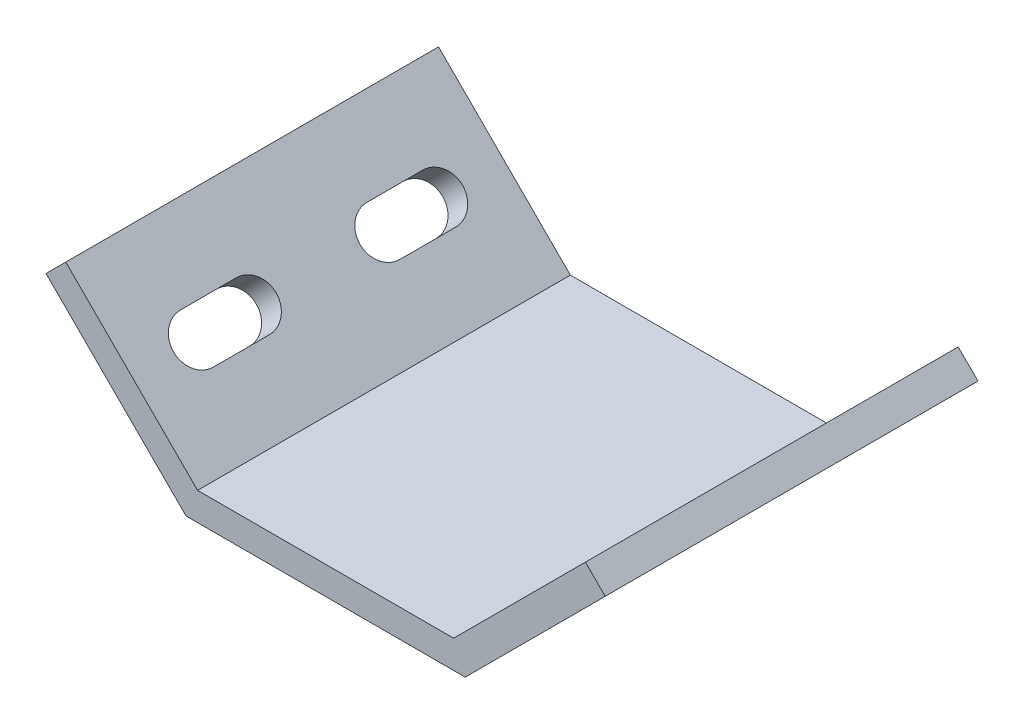
ISO-10303-21;
HEADER;
FILE_DESCRIPTION(('STEP AP214'),'2;1');
FILE_NAME('part.step','',(''),(''),'','','');
FILE_SCHEMA(('AUTOMOTIVE_DESIGN { 1 0 10303 214 1 1 1 1 }'));
ENDSEC;
DATA;
#1=APPLICATION_CONTEXT('core data for automotive mechanical design processes');
#2=APPLICATION_PROTOCOL_DEFINITION('international standard','automotive_design',2000,#1);
#3=PRODUCT_CONTEXT('',#1,'mechanical');
#4=PRODUCT('Part','Part','',(#3));
#5=PRODUCT_RELATED_PRODUCT_CATEGORY('part','',(#4));
#6=PRODUCT_DEFINITION_FORMATION('','',#4);
#7=PRODUCT_DEFINITION_CONTEXT('part definition',#1,'design');
#8=PRODUCT_DEFINITION('design','',#6,#7);
#9=PRODUCT_DEFINITION_SHAPE('','',#8);
#10=(LENGTH_UNIT() NAMED_UNIT(*) SI_UNIT(.MILLI.,.METRE.));
#11=(NAMED_UNIT(*) PLANE_ANGLE_UNIT() SI_UNIT($,.RADIAN.));
#12=(NAMED_UNIT(*) SI_UNIT($,.STERADIAN.) SOLID_ANGLE_UNIT());
#13=UNCERTAINTY_MEASURE_WITH_UNIT(LENGTH_MEASURE(1.E-05),#10,'distance_accuracy_value','');
#14=(GEOMETRIC_REPRESENTATION_CONTEXT(3) GLOBAL_UNCERTAINTY_ASSIGNED_CONTEXT((#13)) GLOBAL_UNIT_ASSIGNED_CONTEXT((#10,
#11,#12)) REPRESENTATION_CONTEXT('',''));
#15=CARTESIAN_POINT('',(0.,0.,0.));
#16=DIRECTION('',(0.,0.,1.));
#17=DIRECTION('',(1.,0.,0.));
#18=AXIS2_PLACEMENT_3D('',#15,#16,#17);
#19=CARTESIAN_POINT('',(15.8578643762691,-2.12132034355965,20.));
#20=DIRECTION('',(-0.707106781186546,0.707106781186549,0.));
#21=DIRECTION('',(-0.707106781186549,-0.707106781186546,0.));
#22=AXIS2_PLACEMENT_3D('',#19,#20,#21);
#23=PLANE('',#22);
#24=DIRECTION('',(0.,0.,-1.));
#25=VECTOR('',#24,1.);
#26=CARTESIAN_POINT('',(14.9791847198287,-3.,20.));
#27=LINE('',#26,#25);
#28=CARTESIAN_POINT('',(14.9791847198287,-3.,20.));
#29=VERTEX_POINT('',#28);
#30=CARTESIAN_POINT('',(14.9791847198287,-3.,-20.));
#31=VERTEX_POINT('',#30);
#32=EDGE_CURVE('E341',#29,#31,#27,.T.);
#33=ORIENTED_EDGE('',*,*,#32,.T.);
#34=DIRECTION('',(0.707106781186549,0.707106781186546,0.));
#35=VECTOR('',#34,1.);
#36=CARTESIAN_POINT('',(15.8578643762691,-2.12132034355965,-20.));
#37=LINE('',#36,#35);
#38=CARTESIAN_POINT('',(30.,12.0208152801712,-20.));
#39=VERTEX_POINT('',#38);
#40=EDGE_CURVE('E234',#31,#39,#37,.T.);
#41=ORIENTED_EDGE('',*,*,#40,.T.);
#42=DIRECTION('',(0.,0.,-1.));
#43=VECTOR('',#42,1.);
#44=CARTESIAN_POINT('',(30.,12.0208152801712,20.));
#45=LINE('',#44,#43);
#46=CARTESIAN_POINT('',(30.,12.0208152801712,20.));
#47=VERTEX_POINT('',#46);
#48=EDGE_CURVE('E355',#47,#39,#45,.T.);
#49=ORIENTED_EDGE('',*,*,#48,.F.);
#50=DIRECTION('',(0.707106781186549,0.707106781186546,0.));
#51=VECTOR('',#50,1.);
#52=CARTESIAN_POINT('',(15.8578643762691,-2.12132034355965,20.));
#53=LINE('',#52,#51);
#54=EDGE_CURVE('E314',#29,#47,#53,.T.);
#55=ORIENTED_EDGE('',*,*,#54,.F.);
#56=EDGE_LOOP('',(#33,#41,#49,#55));
#57=FACE_BOUND('',#56,.T.);
#58=CARTESIAN_POINT('',(22.9289321881345,4.94974746830579,7.));
#59=DIRECTION('',(-0.707106781186546,0.707106781186549,0.));
#60=DIRECTION('',(-0.707106781186549,-0.707106781186546,0.));
#61=AXIS2_PLACEMENT_3D('',#58,#59,#60);
#62=CIRCLE('',#61,2.5);
#63=CARTESIAN_POINT('',(21.1611652351682,3.18198051533942,7.));
#64=VERTEX_POINT('',#63);
#65=CARTESIAN_POINT('',(24.6966991411009,6.71751442127216,7.));
#66=VERTEX_POINT('',#65);
#67=EDGE_CURVE('E298',#64,#66,#62,.F.);
#68=ORIENTED_EDGE('',*,*,#67,.F.);
#69=DIRECTION('',(0.,0.,-1.));
#70=VECTOR('',#69,1.);
#71=CARTESIAN_POINT('',(21.1611652351682,3.18198051533942,20.));
#72=LINE('',#71,#70);
#73=CARTESIAN_POINT('',(21.1611652351682,3.18198051533942,13.));
#74=VERTEX_POINT('',#73);
#75=EDGE_CURVE('E288',#74,#64,#72,.T.);
#76=ORIENTED_EDGE('',*,*,#75,.F.);
#77=CARTESIAN_POINT('',(22.9289321881345,4.94974746830579,13.));
#78=DIRECTION('',(-0.707106781186546,0.707106781186549,0.));
#79=DIRECTION('',(-0.707106781186549,-0.707106781186546,0.));
#80=AXIS2_PLACEMENT_3D('',#77,#78,#79);
#81=CIRCLE('',#80,2.5);
#82=CARTESIAN_POINT('',(24.6966991411009,6.71751442127216,13.));
#83=VERTEX_POINT('',#82);
#84=EDGE_CURVE('E294',#83,#74,#81,.F.);
#85=ORIENTED_EDGE('',*,*,#84,.F.);
#86=DIRECTION('',(0.,0.,1.));
#87=VECTOR('',#86,1.);
#88=CARTESIAN_POINT('',(24.6966991411009,6.71751442127216,20.));
#89=LINE('',#88,#87);
#90=EDGE_CURVE('E296',#66,#83,#89,.T.);
#91=ORIENTED_EDGE('',*,*,#90,.F.);
#92=EDGE_LOOP('',(#68,#76,#85,#91));
#93=FACE_BOUND('',#92,.T.);
#94=CARTESIAN_POINT('',(22.9289321881345,4.94974746830579,-7.));
#95=DIRECTION('',(0.707106781186546,-0.707106781186549,0.));
#96=DIRECTION('',(-0.707106781186549,-0.707106781186546,0.));
#97=AXIS2_PLACEMENT_3D('',#94,#95,#96);
#98=CIRCLE('',#97,2.5);
#99=CARTESIAN_POINT('',(21.1611652351682,3.18198051533942,-7.));
#100=VERTEX_POINT('',#99);
#101=CARTESIAN_POINT('',(24.6966991411009,6.71751442127216,-7.));
#102=VERTEX_POINT('',#101);
#103=EDGE_CURVE('E216',#100,#102,#98,.F.);
#104=ORIENTED_EDGE('',*,*,#103,.T.);
#105=DIRECTION('',(0.,0.,-1.));
#106=VECTOR('',#105,1.);
#107=CARTESIAN_POINT('',(24.6966991411009,6.71751442127216,-20.));
#108=LINE('',#107,#106);
#109=CARTESIAN_POINT('',(24.6966991411009,6.71751442127216,-13.));
#110=VERTEX_POINT('',#109);
#111=EDGE_CURVE('E213',#102,#110,#108,.T.);
#112=ORIENTED_EDGE('',*,*,#111,.T.);
#113=CARTESIAN_POINT('',(22.9289321881345,4.94974746830579,-13.));
#114=DIRECTION('',(0.707106781186546,-0.707106781186549,0.));
#115=DIRECTION('',(-0.707106781186549,-0.707106781186546,0.));
#116=AXIS2_PLACEMENT_3D('',#113,#114,#115);
#117=CIRCLE('',#116,2.5);
#118=CARTESIAN_POINT('',(21.1611652351682,3.18198051533942,-13.));
#119=VERTEX_POINT('',#118);
#120=EDGE_CURVE('E211',#110,#119,#117,.F.);
#121=ORIENTED_EDGE('',*,*,#120,.T.);
#122=DIRECTION('',(0.,0.,1.));
#123=VECTOR('',#122,1.);
#124=CARTESIAN_POINT('',(21.1611652351682,3.18198051533942,-20.));
#125=LINE('',#124,#123);
#126=EDGE_CURVE('E183',#119,#100,#125,.T.);
#127=ORIENTED_EDGE('',*,*,#126,.T.);
#128=EDGE_LOOP('',(#104,#112,#121,#127));
#129=FACE_BOUND('',#128,.T.);
#130=ADVANCED_FACE('F16',(#57,#93,#129),#23,.F.);
#131=CARTESIAN_POINT('',(13.7365440327094,0.,20.));
#132=DIRECTION('',(-0.707106781186546,0.707106781186549,0.));
#133=DIRECTION('',(-0.707106781186549,-0.707106781186546,0.));
#134=AXIS2_PLACEMENT_3D('',#131,#132,#133);
#135=PLANE('',#134);
#136=DIRECTION('',(0.,0.,-1.));
#137=VECTOR('',#136,1.);
#138=CARTESIAN_POINT('',(27.8786796564404,14.1421356237309,20.));
#139=LINE('',#138,#137);
#140=CARTESIAN_POINT('',(27.8786796564404,14.1421356237309,20.));
#141=VERTEX_POINT('',#140);
#142=CARTESIAN_POINT('',(27.8786796564404,14.1421356237309,-20.));
#143=VERTEX_POINT('',#142);
#144=EDGE_CURVE('E353',#141,#143,#139,.T.);
#145=ORIENTED_EDGE('',*,*,#144,.T.);
#146=DIRECTION('',(0.707106781186549,0.707106781186546,0.));
#147=VECTOR('',#146,1.);
#148=CARTESIAN_POINT('',(13.7365440327094,0.,-20.));
#149=LINE('',#148,#147);
#150=CARTESIAN_POINT('',(13.7365440327094,0.,-20.));
#151=VERTEX_POINT('',#150);
#152=EDGE_CURVE('E245',#151,#143,#149,.T.);
#153=ORIENTED_EDGE('',*,*,#152,.F.);
#154=DIRECTION('',(0.,0.,-1.));
#155=VECTOR('',#154,1.);
#156=CARTESIAN_POINT('',(13.7365440327094,0.,20.));
#157=LINE('',#156,#155);
#158=CARTESIAN_POINT('',(13.7365440327094,0.,20.));
#159=VERTEX_POINT('',#158);
#160=EDGE_CURVE('E351',#159,#151,#157,.T.);
#161=ORIENTED_EDGE('',*,*,#160,.F.);
#162=DIRECTION('',(0.707106781186549,0.707106781186546,0.));
#163=VECTOR('',#162,1.);
#164=CARTESIAN_POINT('',(13.7365440327094,0.,20.));
#165=LINE('',#164,#163);
#166=EDGE_CURVE('E325',#159,#141,#165,.T.);
#167=ORIENTED_EDGE('',*,*,#166,.T.);
#168=EDGE_LOOP('',(#145,#153,#161,#167));
#169=FACE_BOUND('',#168,.T.);
#170=DIRECTION('',(0.,0.,-1.));
#171=VECTOR('',#170,1.);
#172=CARTESIAN_POINT('',(19.0398448916085,5.30330085889907,7.));
#173=LINE('',#172,#171);
#174=CARTESIAN_POINT('',(19.0398448916085,5.30330085889907,13.));
#175=VERTEX_POINT('',#174);
#176=CARTESIAN_POINT('',(19.0398448916085,5.30330085889906,7.));
#177=VERTEX_POINT('',#176);
#178=EDGE_CURVE('E276',#175,#177,#173,.T.);
#179=ORIENTED_EDGE('',*,*,#178,.T.);
#180=CARTESIAN_POINT('',(20.8076118445749,7.07106781186544,7.));
#181=DIRECTION('',(0.707106781186546,-0.707106781186549,0.));
#182=DIRECTION('',(0.707106781186549,0.707106781186546,0.));
#183=AXIS2_PLACEMENT_3D('',#180,#181,#182);
#184=CIRCLE('',#183,2.5);
#185=CARTESIAN_POINT('',(22.5753787975413,8.8388347648318,7.));
#186=VERTEX_POINT('',#185);
#187=EDGE_CURVE('E38',#177,#186,#184,.T.);
#188=ORIENTED_EDGE('',*,*,#187,.T.);
#189=DIRECTION('',(0.,0.,1.));
#190=VECTOR('',#189,1.);
#191=CARTESIAN_POINT('',(22.5753787975413,8.8388347648318,7.));
#192=LINE('',#191,#190);
#193=CARTESIAN_POINT('',(22.5753787975413,8.83883476483181,13.));
#194=VERTEX_POINT('',#193);
#195=EDGE_CURVE('E282',#186,#194,#192,.T.);
#196=ORIENTED_EDGE('',*,*,#195,.T.);
#197=CARTESIAN_POINT('',(20.8076118445749,7.07106781186544,13.));
#198=DIRECTION('',(0.707106781186546,-0.707106781186549,0.));
#199=DIRECTION('',(0.707106781186549,0.707106781186546,0.));
#200=AXIS2_PLACEMENT_3D('',#197,#198,#199);
#201=CIRCLE('',#200,2.5);
#202=EDGE_CURVE('E279',#194,#175,#201,.T.);
#203=ORIENTED_EDGE('',*,*,#202,.T.);
#204=EDGE_LOOP('',(#179,#188,#196,#203));
#205=FACE_BOUND('',#204,.T.);
#206=DIRECTION('',(0.,0.,1.));
#207=VECTOR('',#206,1.);
#208=CARTESIAN_POINT('',(19.0398448916085,5.30330085889907,-7.));
#209=LINE('',#208,#207);
#210=CARTESIAN_POINT('',(19.0398448916085,5.30330085889907,-13.));
#211=VERTEX_POINT('',#210);
#212=CARTESIAN_POINT('',(19.0398448916085,5.30330085889906,-7.));
#213=VERTEX_POINT('',#212);
#214=EDGE_CURVE('E181',#211,#213,#209,.T.);
#215=ORIENTED_EDGE('',*,*,#214,.F.);
#216=CARTESIAN_POINT('',(20.8076118445749,7.07106781186544,-13.));
#217=DIRECTION('',(-0.707106781186546,0.707106781186549,0.));
#218=DIRECTION('',(0.707106781186549,0.707106781186546,0.));
#219=AXIS2_PLACEMENT_3D('',#216,#217,#218);
#220=CIRCLE('',#219,2.5);
#221=CARTESIAN_POINT('',(22.5753787975413,8.83883476483181,-13.));
#222=VERTEX_POINT('',#221);
#223=EDGE_CURVE('E191',#222,#211,#220,.T.);
#224=ORIENTED_EDGE('',*,*,#223,.F.);
#225=DIRECTION('',(0.,0.,-1.));
#226=VECTOR('',#225,1.);
#227=CARTESIAN_POINT('',(22.5753787975413,8.8388347648318,-7.));
#228=LINE('',#227,#226);
#229=CARTESIAN_POINT('',(22.5753787975413,8.8388347648318,-7.));
#230=VERTEX_POINT('',#229);
#231=EDGE_CURVE('E196',#230,#222,#228,.T.);
#232=ORIENTED_EDGE('',*,*,#231,.F.);
#233=CARTESIAN_POINT('',(20.8076118445749,7.07106781186544,-7.));
#234=DIRECTION('',(-0.707106781186546,0.707106781186549,0.));
#235=DIRECTION('',(0.707106781186549,0.707106781186546,0.));
#236=AXIS2_PLACEMENT_3D('',#233,#234,#235);
#237=CIRCLE('',#236,2.5);
#238=EDGE_CURVE('E201',#213,#230,#237,.T.);
#239=ORIENTED_EDGE('',*,*,#238,.F.);
#240=EDGE_LOOP('',(#215,#224,#232,#239));
#241=FACE_BOUND('',#240,.T.);
#242=ADVANCED_FACE('F199',(#169,#205,#241),#135,.T.);
#243=CARTESIAN_POINT('',(27.8786796564404,14.1421356237309,20.));
#244=DIRECTION('',(0.707106781186549,0.707106781186546,0.));
#245=DIRECTION('',(-0.707106781186546,0.707106781186549,0.));
#246=AXIS2_PLACEMENT_3D('',#243,#244,#245);
#247=PLANE('',#246);
#248=ORIENTED_EDGE('',*,*,#48,.T.);
#249=DIRECTION('',(0.707106781186546,-0.707106781186549,0.));
#250=VECTOR('',#249,1.);
#251=CARTESIAN_POINT('',(27.8786796564404,14.1421356237309,-20.));
#252=LINE('',#251,#250);
#253=EDGE_CURVE('E242',#143,#39,#252,.T.);
#254=ORIENTED_EDGE('',*,*,#253,.F.);
#255=ORIENTED_EDGE('',*,*,#144,.F.);
#256=DIRECTION('',(0.707106781186546,-0.707106781186549,0.));
#257=VECTOR('',#256,1.);
#258=CARTESIAN_POINT('',(27.8786796564404,14.1421356237309,20.));
#259=LINE('',#258,#257);
#260=EDGE_CURVE('E322',#141,#47,#259,.T.);
#261=ORIENTED_EDGE('',*,*,#260,.T.);
#262=EDGE_LOOP('',(#248,#254,#255,#261));
#263=FACE_BOUND('',#262,.T.);
#264=ADVANCED_FACE('F402',(#263),#247,.T.);
#265=CARTESIAN_POINT('',(-13.7365440327094,0.,20.));
#266=DIRECTION('',(0.,1.,0.));
#267=DIRECTION('',(-1.,0.,0.));
#268=AXIS2_PLACEMENT_3D('',#265,#266,#267);
#269=PLANE('',#268);
#270=ORIENTED_EDGE('',*,*,#160,.T.);
#271=DIRECTION('',(1.,0.,0.));
#272=VECTOR('',#271,1.);
#273=CARTESIAN_POINT('',(-13.7365440327094,0.,-20.));
#274=LINE('',#273,#272);
#275=CARTESIAN_POINT('',(-13.7365440327094,0.,-20.));
#276=VERTEX_POINT('',#275);
#277=EDGE_CURVE('E248',#276,#151,#274,.T.);
#278=ORIENTED_EDGE('',*,*,#277,.F.);
#279=DIRECTION('',(0.,0.,-1.));
#280=VECTOR('',#279,1.);
#281=CARTESIAN_POINT('',(-13.7365440327094,0.,20.));
#282=LINE('',#281,#280);
#283=CARTESIAN_POINT('',(-13.7365440327094,0.,20.));
#284=VERTEX_POINT('',#283);
#285=EDGE_CURVE('E349',#284,#276,#282,.T.);
#286=ORIENTED_EDGE('',*,*,#285,.F.);
#287=DIRECTION('',(1.,0.,0.));
#288=VECTOR('',#287,1.);
#289=CARTESIAN_POINT('',(-13.7365440327094,0.,20.));
#290=LINE('',#289,#288);
#291=EDGE_CURVE('E328',#284,#159,#290,.T.);
#292=ORIENTED_EDGE('',*,*,#291,.T.);
#293=EDGE_LOOP('',(#270,#278,#286,#292));
#294=FACE_BOUND('',#293,.T.);
#295=ADVANCED_FACE('F482',(#294),#269,.T.);
#296=CARTESIAN_POINT('',(-13.7365440327094,0.,20.));
#297=DIRECTION('',(0.707106781186546,0.707106781186549,0.));
#298=DIRECTION('',(-0.707106781186549,0.707106781186546,0.));
#299=AXIS2_PLACEMENT_3D('',#296,#297,#298);
#300=PLANE('',#299);
#301=CARTESIAN_POINT('',(-20.8076118445749,7.07106781186544,7.));
#302=DIRECTION('',(0.707106781186546,0.707106781186549,0.));
#303=DIRECTION('',(-0.707106781186549,0.707106781186546,0.));
#304=AXIS2_PLACEMENT_3D('',#301,#302,#303);
#305=CIRCLE('',#304,2.5);
#306=CARTESIAN_POINT('',(-19.0398448916085,5.30330085889907,7.));
#307=VERTEX_POINT('',#306);
#308=CARTESIAN_POINT('',(-22.5753787975413,8.8388347648318,7.));
#309=VERTEX_POINT('',#308);
#310=EDGE_CURVE('E300',#307,#309,#305,.T.);
#311=ORIENTED_EDGE('',*,*,#310,.F.);
#312=DIRECTION('',(0.,0.,-1.));
#313=VECTOR('',#312,1.);
#314=CARTESIAN_POINT('',(-19.0398448916085,5.30330085889907,7.));
#315=LINE('',#314,#313);
#316=CARTESIAN_POINT('',(-19.0398448916085,5.30330085889907,13.));
#317=VERTEX_POINT('',#316);
#318=EDGE_CURVE('E308',#317,#307,#315,.T.);
#319=ORIENTED_EDGE('',*,*,#318,.F.);
#320=CARTESIAN_POINT('',(-20.8076118445749,7.07106781186544,13.));
#321=DIRECTION('',(0.707106781186546,0.707106781186549,0.));
#322=DIRECTION('',(-0.707106781186549,0.707106781186546,0.));
#323=AXIS2_PLACEMENT_3D('',#320,#321,#322);
#324=CIRCLE('',#323,2.5);
#325=CARTESIAN_POINT('',(-22.5753787975413,8.83883476483181,13.));
#326=VERTEX_POINT('',#325);
#327=EDGE_CURVE('E305',#326,#317,#324,.T.);
#328=ORIENTED_EDGE('',*,*,#327,.F.);
#329=DIRECTION('',(0.,0.,1.));
#330=VECTOR('',#329,1.);
#331=CARTESIAN_POINT('',(-22.5753787975413,8.8388347648318,7.));
#332=LINE('',#331,#330);
#333=EDGE_CURVE('E302',#309,#326,#332,.T.);
#334=ORIENTED_EDGE('',*,*,#333,.F.);
#335=EDGE_LOOP('',(#311,#319,#328,#334));
#336=FACE_BOUND('',#335,.T.);
#337=ORIENTED_EDGE('',*,*,#285,.T.);
#338=DIRECTION('',(0.707106781186549,-0.707106781186546,0.));
#339=VECTOR('',#338,1.);
#340=CARTESIAN_POINT('',(-13.7365440327094,0.,-20.));
#341=LINE('',#340,#339);
#342=CARTESIAN_POINT('',(-27.8786796564404,14.1421356237309,-20.));
#343=VERTEX_POINT('',#342);
#344=EDGE_CURVE('E251',#343,#276,#341,.T.);
#345=ORIENTED_EDGE('',*,*,#344,.F.);
#346=DIRECTION('',(0.,0.,-1.));
#347=VECTOR('',#346,1.);
#348=CARTESIAN_POINT('',(-27.8786796564404,14.1421356237309,20.));
#349=LINE('',#348,#347);
#350=CARTESIAN_POINT('',(-27.8786796564404,14.1421356237309,20.));
#351=VERTEX_POINT('',#350);
#352=EDGE_CURVE('E347',#351,#343,#349,.T.);
#353=ORIENTED_EDGE('',*,*,#352,.F.);
#354=DIRECTION('',(0.707106781186549,-0.707106781186546,0.));
#355=VECTOR('',#354,1.);
#356=CARTESIAN_POINT('',(-13.7365440327094,0.,20.));
#357=LINE('',#356,#355);
#358=EDGE_CURVE('E331',#351,#284,#357,.T.);
#359=ORIENTED_EDGE('',*,*,#358,.T.);
#360=EDGE_LOOP('',(#337,#345,#353,#359));
#361=FACE_BOUND('',#360,.T.);
#362=CARTESIAN_POINT('',(-20.8076118445749,7.07106781186544,-7.));
#363=DIRECTION('',(-0.707106781186546,-0.707106781186549,0.));
#364=DIRECTION('',(-0.707106781186549,0.707106781186546,0.));
#365=AXIS2_PLACEMENT_3D('',#362,#363,#364);
#366=CIRCLE('',#365,2.5);
#367=CARTESIAN_POINT('',(-19.0398448916085,5.30330085889907,-7.));
#368=VERTEX_POINT('',#367);
#369=CARTESIAN_POINT('',(-22.5753787975413,8.8388347648318,-7.));
#370=VERTEX_POINT('',#369);
#371=EDGE_CURVE('E219',#368,#370,#366,.T.);
#372=ORIENTED_EDGE('',*,*,#371,.T.);
#373=DIRECTION('',(0.,0.,-1.));
#374=VECTOR('',#373,1.);
#375=CARTESIAN_POINT('',(-22.5753787975413,8.8388347648318,-7.));
#376=LINE('',#375,#374);
#377=CARTESIAN_POINT('',(-22.5753787975413,8.83883476483181,-13.));
#378=VERTEX_POINT('',#377);
#379=EDGE_CURVE('E222',#370,#378,#376,.T.);
#380=ORIENTED_EDGE('',*,*,#379,.T.);
#381=CARTESIAN_POINT('',(-20.8076118445749,7.07106781186544,-13.));
#382=DIRECTION('',(-0.707106781186546,-0.707106781186549,0.));
#383=DIRECTION('',(-0.707106781186549,0.707106781186546,0.));
#384=AXIS2_PLACEMENT_3D('',#381,#382,#383);
#385=CIRCLE('',#384,2.5);
#386=CARTESIAN_POINT('',(-19.0398448916085,5.30330085889907,-13.));
#387=VERTEX_POINT('',#386);
#388=EDGE_CURVE('E225',#378,#387,#385,.T.);
#389=ORIENTED_EDGE('',*,*,#388,.T.);
#390=DIRECTION('',(0.,0.,1.));
#391=VECTOR('',#390,1.);
#392=CARTESIAN_POINT('',(-19.0398448916085,5.30330085889907,-7.));
#393=LINE('',#392,#391);
#394=EDGE_CURVE('E228',#387,#368,#393,.T.);
#395=ORIENTED_EDGE('',*,*,#394,.T.);
#396=EDGE_LOOP('',(#372,#380,#389,#395));
#397=FACE_BOUND('',#396,.T.);
#398=ADVANCED_FACE('F378',(#336,#361,#397),#300,.T.);
#399=CARTESIAN_POINT('',(-30.,12.0208152801712,20.));
#400=DIRECTION('',(-0.707106781186549,0.707106781186546,0.));
#401=DIRECTION('',(-0.707106781186546,-0.707106781186549,0.));
#402=AXIS2_PLACEMENT_3D('',#399,#400,#401);
#403=PLANE('',#402);
#404=ORIENTED_EDGE('',*,*,#352,.T.);
#405=DIRECTION('',(0.707106781186546,0.707106781186549,0.));
#406=VECTOR('',#405,1.);
#407=CARTESIAN_POINT('',(-30.,12.0208152801712,-20.));
#408=LINE('',#407,#406);
#409=CARTESIAN_POINT('',(-30.,12.0208152801712,-20.));
#410=VERTEX_POINT('',#409);
#411=EDGE_CURVE('E254',#410,#343,#408,.T.);
#412=ORIENTED_EDGE('',*,*,#411,.F.);
#413=DIRECTION('',(0.,0.,-1.));
#414=VECTOR('',#413,1.);
#415=CARTESIAN_POINT('',(-30.,12.0208152801712,20.));
#416=LINE('',#415,#414);
#417=CARTESIAN_POINT('',(-30.,12.0208152801712,20.));
#418=VERTEX_POINT('',#417);
#419=EDGE_CURVE('E345',#418,#410,#416,.T.);
#420=ORIENTED_EDGE('',*,*,#419,.F.);
#421=DIRECTION('',(0.707106781186546,0.707106781186549,0.));
#422=VECTOR('',#421,1.);
#423=CARTESIAN_POINT('',(-30.,12.0208152801712,20.));
#424=LINE('',#423,#422);
#425=EDGE_CURVE('E334',#418,#351,#424,.T.);
#426=ORIENTED_EDGE('',*,*,#425,.T.);
#427=EDGE_LOOP('',(#404,#412,#420,#426));
#428=FACE_BOUND('',#427,.T.);
#429=ADVANCED_FACE('F476',(#428),#403,.T.);
#430=CARTESIAN_POINT('',(-15.8578643762691,-2.12132034355965,20.));
#431=DIRECTION('',(0.707106781186546,0.707106781186549,0.));
#432=DIRECTION('',(-0.707106781186549,0.707106781186546,0.));
#433=AXIS2_PLACEMENT_3D('',#430,#431,#432);
#434=PLANE('',#433);
#435=DIRECTION('',(0.,0.,-1.));
#436=VECTOR('',#435,1.);
#437=CARTESIAN_POINT('',(-21.1611652351682,3.18198051533942,20.));
#438=LINE('',#437,#436);
#439=CARTESIAN_POINT('',(-21.1611652351682,3.18198051533942,13.));
#440=VERTEX_POINT('',#439);
#441=CARTESIAN_POINT('',(-21.1611652351682,3.18198051533942,7.));
#442=VERTEX_POINT('',#441);
#443=EDGE_CURVE('E23',#440,#442,#438,.T.);
#444=ORIENTED_EDGE('',*,*,#443,.T.);
#445=CARTESIAN_POINT('',(-22.9289321881345,4.94974746830579,7.));
#446=DIRECTION('',(0.707106781186546,0.707106781186549,0.));
#447=DIRECTION('',(-0.707106781186549,0.707106781186546,0.));
#448=AXIS2_PLACEMENT_3D('',#445,#446,#447);
#449=CIRCLE('',#448,2.5);
#450=CARTESIAN_POINT('',(-24.6966991411009,6.71751442127216,7.));
#451=VERTEX_POINT('',#450);
#452=EDGE_CURVE('E10',#442,#451,#449,.T.);
#453=ORIENTED_EDGE('',*,*,#452,.T.);
#454=DIRECTION('',(0.,0.,1.));
#455=VECTOR('',#454,1.);
#456=CARTESIAN_POINT('',(-24.6966991411009,6.71751442127216,20.));
#457=LINE('',#456,#455);
#458=CARTESIAN_POINT('',(-24.6966991411009,6.71751442127216,13.));
#459=VERTEX_POINT('',#458);
#460=EDGE_CURVE('E357',#451,#459,#457,.T.);
#461=ORIENTED_EDGE('',*,*,#460,.T.);
#462=CARTESIAN_POINT('',(-22.9289321881345,4.94974746830579,13.));
#463=DIRECTION('',(0.707106781186546,0.707106781186549,0.));
#464=DIRECTION('',(-0.707106781186549,0.707106781186546,0.));
#465=AXIS2_PLACEMENT_3D('',#462,#463,#464);
#466=CIRCLE('',#465,2.5);
#467=EDGE_CURVE('E360',#459,#440,#466,.T.);
#468=ORIENTED_EDGE('',*,*,#467,.T.);
#469=EDGE_LOOP('',(#444,#453,#461,#468));
#470=FACE_BOUND('',#469,.T.);
#471=ORIENTED_EDGE('',*,*,#419,.T.);
#472=DIRECTION('',(0.707106781186549,-0.707106781186546,0.));
#473=VECTOR('',#472,1.);
#474=CARTESIAN_POINT('',(-15.8578643762691,-2.12132034355965,-20.));
#475=LINE('',#474,#473);
#476=CARTESIAN_POINT('',(-14.9791847198287,-3.,-20.));
#477=VERTEX_POINT('',#476);
#478=EDGE_CURVE('E257',#410,#477,#475,.T.);
#479=ORIENTED_EDGE('',*,*,#478,.T.);
#480=DIRECTION('',(0.,0.,-1.));
#481=VECTOR('',#480,1.);
#482=CARTESIAN_POINT('',(-14.9791847198287,-3.,20.));
#483=LINE('',#482,#481);
#484=CARTESIAN_POINT('',(-14.9791847198287,-3.,20.));
#485=VERTEX_POINT('',#484);
#486=EDGE_CURVE('E343',#485,#477,#483,.T.);
#487=ORIENTED_EDGE('',*,*,#486,.F.);
#488=DIRECTION('',(0.707106781186549,-0.707106781186546,0.));
#489=VECTOR('',#488,1.);
#490=CARTESIAN_POINT('',(-15.8578643762691,-2.12132034355965,20.));
#491=LINE('',#490,#489);
#492=EDGE_CURVE('E337',#418,#485,#491,.T.);
#493=ORIENTED_EDGE('',*,*,#492,.F.);
#494=EDGE_LOOP('',(#471,#479,#487,#493));
#495=FACE_BOUND('',#494,.T.);
#496=DIRECTION('',(0.,0.,1.));
#497=VECTOR('',#496,1.);
#498=CARTESIAN_POINT('',(-21.1611652351682,3.18198051533942,-20.));
#499=LINE('',#498,#497);
#500=CARTESIAN_POINT('',(-21.1611652351682,3.18198051533942,-13.));
#501=VERTEX_POINT('',#500);
#502=CARTESIAN_POINT('',(-21.1611652351682,3.18198051533942,-7.));
#503=VERTEX_POINT('',#502);
#504=EDGE_CURVE('E269',#501,#503,#499,.T.);
#505=ORIENTED_EDGE('',*,*,#504,.F.);
#506=CARTESIAN_POINT('',(-22.9289321881345,4.94974746830579,-13.));
#507=DIRECTION('',(-0.707106781186546,-0.707106781186549,0.));
#508=DIRECTION('',(-0.707106781186549,0.707106781186546,0.));
#509=AXIS2_PLACEMENT_3D('',#506,#507,#508);
#510=CIRCLE('',#509,2.5);
#511=CARTESIAN_POINT('',(-24.6966991411009,6.71751442127216,-13.));
#512=VERTEX_POINT('',#511);
#513=EDGE_CURVE('E266',#512,#501,#510,.T.);
#514=ORIENTED_EDGE('',*,*,#513,.F.);
#515=DIRECTION('',(0.,0.,-1.));
#516=VECTOR('',#515,1.);
#517=CARTESIAN_POINT('',(-24.6966991411009,6.71751442127216,-20.));
#518=LINE('',#517,#516);
#519=CARTESIAN_POINT('',(-24.6966991411009,6.71751442127216,-7.));
#520=VERTEX_POINT('',#519);
#521=EDGE_CURVE('E263',#520,#512,#518,.T.);
#522=ORIENTED_EDGE('',*,*,#521,.F.);
#523=CARTESIAN_POINT('',(-22.9289321881345,4.94974746830579,-7.));
#524=DIRECTION('',(-0.707106781186546,-0.707106781186549,0.));
#525=DIRECTION('',(-0.707106781186549,0.707106781186546,0.));
#526=AXIS2_PLACEMENT_3D('',#523,#524,#525);
#527=CIRCLE('',#526,2.5);
#528=EDGE_CURVE('E272',#503,#520,#527,.T.);
#529=ORIENTED_EDGE('',*,*,#528,.F.);
#530=EDGE_LOOP('',(#505,#514,#522,#529));
#531=FACE_BOUND('',#530,.T.);
#532=ADVANCED_FACE('F364',(#470,#495,#531),#434,.F.);
#533=CARTESIAN_POINT('',(-13.7365440327094,-3.,20.));
#534=DIRECTION('',(0.,1.,0.));
#535=DIRECTION('',(-1.,0.,0.));
#536=AXIS2_PLACEMENT_3D('',#533,#534,#535);
#537=PLANE('',#536);
#538=ORIENTED_EDGE('',*,*,#486,.T.);
#539=DIRECTION('',(1.,0.,0.));
#540=VECTOR('',#539,1.);
#541=CARTESIAN_POINT('',(-13.7365440327094,-3.,-20.));
#542=LINE('',#541,#540);
#543=EDGE_CURVE('E260',#477,#31,#542,.T.);
#544=ORIENTED_EDGE('',*,*,#543,.T.);
#545=ORIENTED_EDGE('',*,*,#32,.F.);
#546=DIRECTION('',(1.,0.,0.));
#547=VECTOR('',#546,1.);
#548=CARTESIAN_POINT('',(-13.7365440327094,-3.,20.));
#549=LINE('',#548,#547);
#550=EDGE_CURVE('E339',#485,#29,#549,.T.);
#551=ORIENTED_EDGE('',*,*,#550,.F.);
#552=EDGE_LOOP('',(#538,#544,#545,#551));
#553=FACE_BOUND('',#552,.T.);
#554=ADVANCED_FACE('F467',(#553),#537,.F.);
#555=CARTESIAN_POINT('',(0.,0.,20.));
#556=DIRECTION('',(0.,0.,-1.));
#557=DIRECTION('',(-1.,0.,0.));
#558=AXIS2_PLACEMENT_3D('',#555,#556,#557);
#559=PLANE('',#558);
#560=ORIENTED_EDGE('',*,*,#54,.T.);
#561=ORIENTED_EDGE('',*,*,#260,.F.);
#562=ORIENTED_EDGE('',*,*,#166,.F.);
#563=ORIENTED_EDGE('',*,*,#291,.F.);
#564=ORIENTED_EDGE('',*,*,#358,.F.);
#565=ORIENTED_EDGE('',*,*,#425,.F.);
#566=ORIENTED_EDGE('',*,*,#492,.T.);
#567=ORIENTED_EDGE('',*,*,#550,.T.);
#568=EDGE_LOOP('',(#560,#561,#562,#563,#564,#565,#566,#567));
#569=FACE_BOUND('',#568,.T.);
#570=ADVANCED_FACE('F463',(#569),#559,.F.);
#571=CARTESIAN_POINT('',(-30.4393398282201,-2.56066017177985,7.));
#572=DIRECTION('',(0.707106781186546,0.707106781186549,0.));
#573=DIRECTION('',(-0.707106781186549,0.707106781186546,0.));
#574=AXIS2_PLACEMENT_3D('',#571,#572,#573);
#575=CYLINDRICAL_SURFACE('',#574,2.5);
#576=DIRECTION('',(0.707106781186546,0.707106781186549,0.));
#577=VECTOR('',#576,1.);
#578=CARTESIAN_POINT('',(-28.6715728752538,-4.32842712474622,7.));
#579=LINE('',#578,#577);
#580=EDGE_CURVE('E312',#442,#307,#579,.T.);
#581=ORIENTED_EDGE('',*,*,#580,.T.);
#582=ORIENTED_EDGE('',*,*,#310,.T.);
#583=DIRECTION('',(0.707106781186546,0.707106781186549,0.));
#584=VECTOR('',#583,1.);
#585=CARTESIAN_POINT('',(-32.2071067811865,-0.792893218813486,7.));
#586=LINE('',#585,#584);
#587=EDGE_CURVE('E311',#451,#309,#586,.T.);
#588=ORIENTED_EDGE('',*,*,#587,.F.);
#589=ORIENTED_EDGE('',*,*,#452,.F.);
#590=EDGE_LOOP('',(#581,#582,#588,#589));
#591=FACE_BOUND('',#590,.T.);
#592=ADVANCED_FACE('F382',(#591),#575,.F.);
#593=CARTESIAN_POINT('',(-28.6715728752538,-4.32842712474622,7.));
#594=DIRECTION('',(0.707106781186549,-0.707106781186546,0.));
#595=DIRECTION('',(0.707106781186546,0.707106781186549,0.));
#596=AXIS2_PLACEMENT_3D('',#593,#594,#595);
#597=PLANE('',#596);
#598=DIRECTION('',(0.707106781186546,0.707106781186549,0.));
#599=VECTOR('',#598,1.);
#600=CARTESIAN_POINT('',(-28.6715728752538,-4.32842712474622,13.));
#601=LINE('',#600,#599);
#602=EDGE_CURVE('E315',#440,#317,#601,.T.);
#603=ORIENTED_EDGE('',*,*,#602,.T.);
#604=ORIENTED_EDGE('',*,*,#318,.T.);
#605=ORIENTED_EDGE('',*,*,#580,.F.);
#606=ORIENTED_EDGE('',*,*,#443,.F.);
#607=EDGE_LOOP('',(#603,#604,#605,#606));
#608=FACE_BOUND('',#607,.T.);
#609=ADVANCED_FACE('F370',(#608),#597,.F.);
#610=CARTESIAN_POINT('',(-30.4393398282201,-2.56066017177985,13.));
#611=DIRECTION('',(0.707106781186546,0.707106781186549,0.));
#612=DIRECTION('',(-0.707106781186549,0.707106781186546,0.));
#613=AXIS2_PLACEMENT_3D('',#610,#611,#612);
#614=CYLINDRICAL_SURFACE('',#613,2.5);
#615=DIRECTION('',(0.707106781186546,0.707106781186549,0.));
#616=VECTOR('',#615,1.);
#617=CARTESIAN_POINT('',(-32.2071067811865,-0.792893218813481,13.));
#618=LINE('',#617,#616);
#619=EDGE_CURVE('E317',#459,#326,#618,.T.);
#620=ORIENTED_EDGE('',*,*,#619,.T.);
#621=ORIENTED_EDGE('',*,*,#327,.T.);
#622=ORIENTED_EDGE('',*,*,#602,.F.);
#623=ORIENTED_EDGE('',*,*,#467,.F.);
#624=EDGE_LOOP('',(#620,#621,#622,#623));
#625=FACE_BOUND('',#624,.T.);
#626=ADVANCED_FACE('F372',(#625),#614,.F.);
#627=CARTESIAN_POINT('',(-32.2071067811865,-0.792893218813486,7.));
#628=DIRECTION('',(-0.707106781186549,0.707106781186546,0.));
#629=DIRECTION('',(-0.707106781186546,-0.707106781186549,0.));
#630=AXIS2_PLACEMENT_3D('',#627,#628,#629);
#631=PLANE('',#630);
#632=ORIENTED_EDGE('',*,*,#587,.T.);
#633=ORIENTED_EDGE('',*,*,#333,.T.);
#634=ORIENTED_EDGE('',*,*,#619,.F.);
#635=ORIENTED_EDGE('',*,*,#460,.F.);
#636=EDGE_LOOP('',(#632,#633,#634,#635));
#637=FACE_BOUND('',#636,.T.);
#638=ADVANCED_FACE('F384',(#637),#631,.F.);
#639=CARTESIAN_POINT('',(30.4393398282201,-2.56066017177985,7.));
#640=DIRECTION('',(-0.707106781186546,0.707106781186549,0.));
#641=DIRECTION('',(-0.707106781186549,-0.707106781186546,0.));
#642=AXIS2_PLACEMENT_3D('',#639,#640,#641);
#643=CYLINDRICAL_SURFACE('',#642,2.5);
#644=ORIENTED_EDGE('',*,*,#67,.T.);
#645=DIRECTION('',(-0.707106781186546,0.707106781186549,0.));
#646=VECTOR('',#645,1.);
#647=CARTESIAN_POINT('',(32.2071067811865,-0.792893218813486,7.));
#648=LINE('',#647,#646);
#649=EDGE_CURVE('E286',#66,#186,#648,.T.);
#650=ORIENTED_EDGE('',*,*,#649,.T.);
#651=ORIENTED_EDGE('',*,*,#187,.F.);
#652=DIRECTION('',(-0.707106781186546,0.707106781186549,0.));
#653=VECTOR('',#652,1.);
#654=CARTESIAN_POINT('',(28.6715728752538,-4.32842712474622,7.));
#655=LINE('',#654,#653);
#656=EDGE_CURVE('E285',#64,#177,#655,.T.);
#657=ORIENTED_EDGE('',*,*,#656,.F.);
#658=EDGE_LOOP('',(#644,#650,#651,#657));
#659=FACE_BOUND('',#658,.T.);
#660=ADVANCED_FACE('F386',(#659),#643,.F.);
#661=CARTESIAN_POINT('',(32.2071067811865,-0.792893218813486,7.));
#662=DIRECTION('',(-0.707106781186549,-0.707106781186546,0.));
#663=DIRECTION('',(0.707106781186546,-0.707106781186549,0.));
#664=AXIS2_PLACEMENT_3D('',#661,#662,#663);
#665=PLANE('',#664);
#666=ORIENTED_EDGE('',*,*,#90,.T.);
#667=DIRECTION('',(-0.707106781186546,0.707106781186549,0.));
#668=VECTOR('',#667,1.);
#669=CARTESIAN_POINT('',(32.2071067811865,-0.792893218813481,13.));
#670=LINE('',#669,#668);
#671=EDGE_CURVE('E289',#83,#194,#670,.T.);
#672=ORIENTED_EDGE('',*,*,#671,.T.);
#673=ORIENTED_EDGE('',*,*,#195,.F.);
#674=ORIENTED_EDGE('',*,*,#649,.F.);
#675=EDGE_LOOP('',(#666,#672,#673,#674));
#676=FACE_BOUND('',#675,.T.);
#677=ADVANCED_FACE('F393',(#676),#665,.T.);
#678=CARTESIAN_POINT('',(30.4393398282201,-2.56066017177985,13.));
#679=DIRECTION('',(-0.707106781186546,0.707106781186549,0.));
#680=DIRECTION('',(-0.707106781186549,-0.707106781186546,0.));
#681=AXIS2_PLACEMENT_3D('',#678,#679,#680);
#682=CYLINDRICAL_SURFACE('',#681,2.5);
#683=ORIENTED_EDGE('',*,*,#84,.T.);
#684=DIRECTION('',(-0.707106781186546,0.707106781186549,0.));
#685=VECTOR('',#684,1.);
#686=CARTESIAN_POINT('',(28.6715728752538,-4.32842712474622,13.));
#687=LINE('',#686,#685);
#688=EDGE_CURVE('E30',#74,#175,#687,.T.);
#689=ORIENTED_EDGE('',*,*,#688,.T.);
#690=ORIENTED_EDGE('',*,*,#202,.F.);
#691=ORIENTED_EDGE('',*,*,#671,.F.);
#692=EDGE_LOOP('',(#683,#689,#690,#691));
#693=FACE_BOUND('',#692,.T.);
#694=ADVANCED_FACE('F452',(#693),#682,.F.);
#695=CARTESIAN_POINT('',(28.6715728752538,-4.32842712474622,7.));
#696=DIRECTION('',(0.707106781186549,0.707106781186546,0.));
#697=DIRECTION('',(-0.707106781186546,0.707106781186549,0.));
#698=AXIS2_PLACEMENT_3D('',#695,#696,#697);
#699=PLANE('',#698);
#700=ORIENTED_EDGE('',*,*,#75,.T.);
#701=ORIENTED_EDGE('',*,*,#656,.T.);
#702=ORIENTED_EDGE('',*,*,#178,.F.);
#703=ORIENTED_EDGE('',*,*,#688,.F.);
#704=EDGE_LOOP('',(#700,#701,#702,#703));
#705=FACE_BOUND('',#704,.T.);
#706=ADVANCED_FACE('F448',(#705),#699,.T.);
#707=CARTESIAN_POINT('',(0.,0.,-20.));
#708=DIRECTION('',(0.,0.,1.));
#709=DIRECTION('',(-1.,0.,0.));
#710=AXIS2_PLACEMENT_3D('',#707,#708,#709);
#711=PLANE('',#710);
#712=ORIENTED_EDGE('',*,*,#40,.F.);
#713=ORIENTED_EDGE('',*,*,#543,.F.);
#714=ORIENTED_EDGE('',*,*,#478,.F.);
#715=ORIENTED_EDGE('',*,*,#411,.T.);
#716=ORIENTED_EDGE('',*,*,#344,.T.);
#717=ORIENTED_EDGE('',*,*,#277,.T.);
#718=ORIENTED_EDGE('',*,*,#152,.T.);
#719=ORIENTED_EDGE('',*,*,#253,.T.);
#720=EDGE_LOOP('',(#712,#713,#714,#715,#716,#717,#718,#719));
#721=FACE_BOUND('',#720,.T.);
#722=ADVANCED_FACE('F444',(#721),#711,.F.);
#723=CARTESIAN_POINT('',(-30.4393398282201,-2.56066017177985,-7.));
#724=DIRECTION('',(0.707106781186546,0.707106781186549,0.));
#725=DIRECTION('',(-0.707106781186549,0.707106781186546,0.));
#726=AXIS2_PLACEMENT_3D('',#723,#724,#725);
#727=CYLINDRICAL_SURFACE('',#726,2.5);
#728=DIRECTION('',(0.707106781186546,0.707106781186549,0.));
#729=VECTOR('',#728,1.);
#730=CARTESIAN_POINT('',(-28.6715728752538,-4.32842712474622,-7.));
#731=LINE('',#730,#729);
#732=EDGE_CURVE('E232',#503,#368,#731,.T.);
#733=ORIENTED_EDGE('',*,*,#732,.F.);
#734=ORIENTED_EDGE('',*,*,#528,.T.);
#735=DIRECTION('',(0.707106781186546,0.707106781186549,0.));
#736=VECTOR('',#735,1.);
#737=CARTESIAN_POINT('',(-32.2071067811865,-0.792893218813486,-7.));
#738=LINE('',#737,#736);
#739=EDGE_CURVE('E231',#520,#370,#738,.T.);
#740=ORIENTED_EDGE('',*,*,#739,.T.);
#741=ORIENTED_EDGE('',*,*,#371,.F.);
#742=EDGE_LOOP('',(#733,#734,#740,#741));
#743=FACE_BOUND('',#742,.T.);
#744=ADVANCED_FACE('F434',(#743),#727,.F.);
#745=CARTESIAN_POINT('',(-28.6715728752538,-4.32842712474622,-7.));
#746=DIRECTION('',(0.707106781186549,-0.707106781186546,0.));
#747=DIRECTION('',(0.707106781186546,0.707106781186549,0.));
#748=AXIS2_PLACEMENT_3D('',#745,#746,#747);
#749=PLANE('',#748);
#750=DIRECTION('',(0.707106781186546,0.707106781186549,0.));
#751=VECTOR('',#750,1.);
#752=CARTESIAN_POINT('',(-28.6715728752538,-4.32842712474622,-13.));
#753=LINE('',#752,#751);
#754=EDGE_CURVE('E235',#501,#387,#753,.T.);
#755=ORIENTED_EDGE('',*,*,#754,.F.);
#756=ORIENTED_EDGE('',*,*,#504,.T.);
#757=ORIENTED_EDGE('',*,*,#732,.T.);
#758=ORIENTED_EDGE('',*,*,#394,.F.);
#759=EDGE_LOOP('',(#755,#756,#757,#758));
#760=FACE_BOUND('',#759,.T.);
#761=ADVANCED_FACE('F430',(#760),#749,.F.);
#762=CARTESIAN_POINT('',(-30.4393398282201,-2.56066017177985,-13.));
#763=DIRECTION('',(0.707106781186546,0.707106781186549,0.));
#764=DIRECTION('',(-0.707106781186549,0.707106781186546,0.));
#765=AXIS2_PLACEMENT_3D('',#762,#763,#764);
#766=CYLINDRICAL_SURFACE('',#765,2.5);
#767=DIRECTION('',(0.707106781186546,0.707106781186549,0.));
#768=VECTOR('',#767,1.);
#769=CARTESIAN_POINT('',(-32.2071067811865,-0.792893218813481,-13.));
#770=LINE('',#769,#768);
#771=EDGE_CURVE('E237',#512,#378,#770,.T.);
#772=ORIENTED_EDGE('',*,*,#771,.F.);
#773=ORIENTED_EDGE('',*,*,#513,.T.);
#774=ORIENTED_EDGE('',*,*,#754,.T.);
#775=ORIENTED_EDGE('',*,*,#388,.F.);
#776=EDGE_LOOP('',(#772,#773,#774,#775));
#777=FACE_BOUND('',#776,.T.);
#778=ADVANCED_FACE('F433',(#777),#766,.F.);
#779=CARTESIAN_POINT('',(-32.2071067811865,-0.792893218813486,-7.));
#780=DIRECTION('',(-0.707106781186549,0.707106781186546,0.));
#781=DIRECTION('',(-0.707106781186546,-0.707106781186549,0.));
#782=AXIS2_PLACEMENT_3D('',#779,#780,#781);
#783=PLANE('',#782);
#784=ORIENTED_EDGE('',*,*,#739,.F.);
#785=ORIENTED_EDGE('',*,*,#521,.T.);
#786=ORIENTED_EDGE('',*,*,#771,.T.);
#787=ORIENTED_EDGE('',*,*,#379,.F.);
#788=EDGE_LOOP('',(#784,#785,#786,#787));
#789=FACE_BOUND('',#788,.T.);
#790=ADVANCED_FACE('F425',(#789),#783,.F.);
#791=CARTESIAN_POINT('',(30.4393398282201,-2.56066017177985,-7.));
#792=DIRECTION('',(-0.707106781186546,0.707106781186549,0.));
#793=DIRECTION('',(-0.707106781186549,-0.707106781186546,0.));
#794=AXIS2_PLACEMENT_3D('',#791,#792,#793);
#795=CYLINDRICAL_SURFACE('',#794,2.5);
#796=ORIENTED_EDGE('',*,*,#103,.F.);
#797=DIRECTION('',(-0.707106781186546,0.707106781186549,0.));
#798=VECTOR('',#797,1.);
#799=CARTESIAN_POINT('',(28.6715728752538,-4.32842712474622,-7.));
#800=LINE('',#799,#798);
#801=EDGE_CURVE('E188',#100,#213,#800,.T.);
#802=ORIENTED_EDGE('',*,*,#801,.T.);
#803=ORIENTED_EDGE('',*,*,#238,.T.);
#804=DIRECTION('',(-0.707106781186546,0.707106781186549,0.));
#805=VECTOR('',#804,1.);
#806=CARTESIAN_POINT('',(32.2071067811865,-0.792893218813486,-7.));
#807=LINE('',#806,#805);
#808=EDGE_CURVE('E206',#102,#230,#807,.T.);
#809=ORIENTED_EDGE('',*,*,#808,.F.);
#810=EDGE_LOOP('',(#796,#802,#803,#809));
#811=FACE_BOUND('',#810,.T.);
#812=ADVANCED_FACE('F415',(#811),#795,.F.);
#813=CARTESIAN_POINT('',(32.2071067811865,-0.792893218813486,-7.));
#814=DIRECTION('',(-0.707106781186549,-0.707106781186546,0.));
#815=DIRECTION('',(0.707106781186546,-0.707106781186549,0.));
#816=AXIS2_PLACEMENT_3D('',#813,#814,#815);
#817=PLANE('',#816);
#818=ORIENTED_EDGE('',*,*,#111,.F.);
#819=ORIENTED_EDGE('',*,*,#808,.T.);
#820=ORIENTED_EDGE('',*,*,#231,.T.);
#821=DIRECTION('',(-0.707106781186546,0.707106781186549,0.));
#822=VECTOR('',#821,1.);
#823=CARTESIAN_POINT('',(32.2071067811865,-0.792893218813481,-13.));
#824=LINE('',#823,#822);
#825=EDGE_CURVE('E187',#110,#222,#824,.T.);
#826=ORIENTED_EDGE('',*,*,#825,.F.);
#827=EDGE_LOOP('',(#818,#819,#820,#826));
#828=FACE_BOUND('',#827,.T.);
#829=ADVANCED_FACE('F417',(#828),#817,.T.);
#830=CARTESIAN_POINT('',(30.4393398282201,-2.56066017177985,-13.));
#831=DIRECTION('',(-0.707106781186546,0.707106781186549,0.));
#832=DIRECTION('',(-0.707106781186549,-0.707106781186546,0.));
#833=AXIS2_PLACEMENT_3D('',#830,#831,#832);
#834=CYLINDRICAL_SURFACE('',#833,2.5);
#835=ORIENTED_EDGE('',*,*,#120,.F.);
#836=ORIENTED_EDGE('',*,*,#825,.T.);
#837=ORIENTED_EDGE('',*,*,#223,.T.);
#838=DIRECTION('',(-0.707106781186546,0.707106781186549,0.));
#839=VECTOR('',#838,1.);
#840=CARTESIAN_POINT('',(28.6715728752538,-4.32842712474622,-13.));
#841=LINE('',#840,#839);
#842=EDGE_CURVE('E177',#119,#211,#841,.T.);
#843=ORIENTED_EDGE('',*,*,#842,.F.);
#844=EDGE_LOOP('',(#835,#836,#837,#843));
#845=FACE_BOUND('',#844,.T.);
#846=ADVANCED_FACE('F192',(#845),#834,.F.);
#847=CARTESIAN_POINT('',(28.6715728752538,-4.32842712474622,-7.));
#848=DIRECTION('',(0.707106781186549,0.707106781186546,0.));
#849=DIRECTION('',(-0.707106781186546,0.707106781186549,0.));
#850=AXIS2_PLACEMENT_3D('',#847,#848,#849);
#851=PLANE('',#850);
#852=ORIENTED_EDGE('',*,*,#126,.F.);
#853=ORIENTED_EDGE('',*,*,#842,.T.);
#854=ORIENTED_EDGE('',*,*,#214,.T.);
#855=ORIENTED_EDGE('',*,*,#801,.F.);
#856=EDGE_LOOP('',(#852,#853,#854,#855));
#857=FACE_BOUND('',#856,.T.);
#858=ADVANCED_FACE('F179',(#857),#851,.T.);
#859=CLOSED_SHELL('',(#130,#242,#264,#295,#398,#429,#532,#554,#570,#592,#609,#626,#638,#660,
#677,#694,#706,#722,#744,#761,#778,#790,#812,#829,#846,#858));
#860=MANIFOLD_SOLID_BREP('B1',#859);
#861=ADVANCED_BREP_SHAPE_REPRESENTATION('',(#18,#860),#14);
#862=SHAPE_DEFINITION_REPRESENTATION(#9,#861);
ENDSEC;
END-ISO-10303-21;
